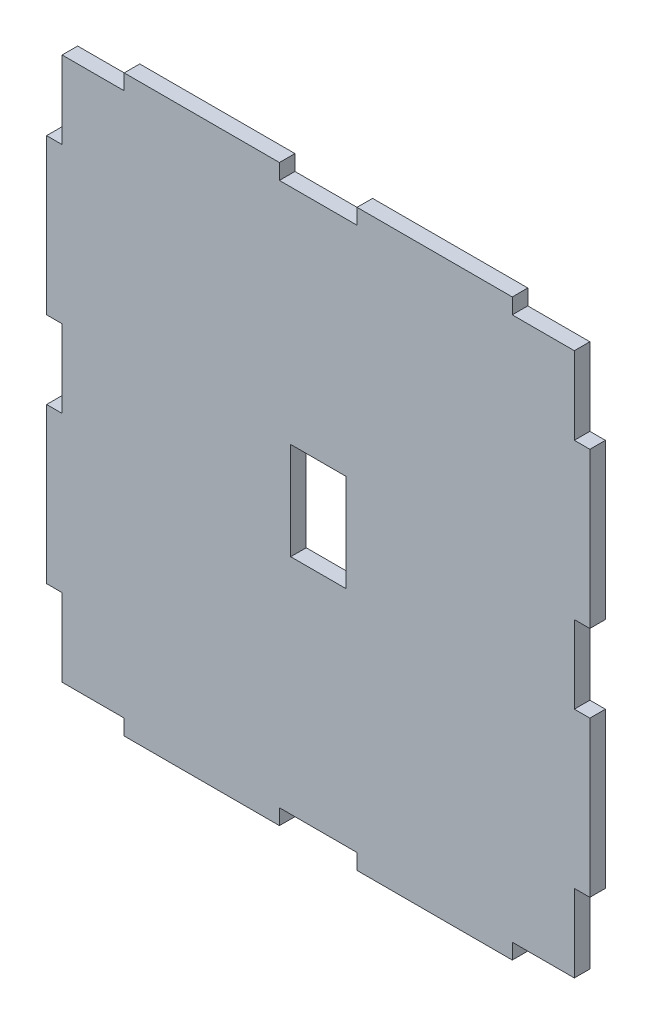
ISO-10303-21;
HEADER;
FILE_DESCRIPTION(('STEP AP214'),'2;1');
FILE_NAME('part.step','',(''),(''),'','','');
FILE_SCHEMA(('AUTOMOTIVE_DESIGN { 1 0 10303 214 1 1 1 1 }'));
ENDSEC;
DATA;
#1=APPLICATION_CONTEXT('core data for automotive mechanical design processes');
#2=APPLICATION_PROTOCOL_DEFINITION('international standard','automotive_design',2000,#1);
#3=PRODUCT_CONTEXT('',#1,'mechanical');
#4=PRODUCT('Part','Part','',(#3));
#5=PRODUCT_RELATED_PRODUCT_CATEGORY('part','',(#4));
#6=PRODUCT_DEFINITION_FORMATION('','',#4);
#7=PRODUCT_DEFINITION_CONTEXT('part definition',#1,'design');
#8=PRODUCT_DEFINITION('design','',#6,#7);
#9=PRODUCT_DEFINITION_SHAPE('','',#8);
#10=(LENGTH_UNIT() NAMED_UNIT(*) SI_UNIT(.MILLI.,.METRE.));
#11=(NAMED_UNIT(*) PLANE_ANGLE_UNIT() SI_UNIT($,.RADIAN.));
#12=(NAMED_UNIT(*) SI_UNIT($,.STERADIAN.) SOLID_ANGLE_UNIT());
#13=UNCERTAINTY_MEASURE_WITH_UNIT(LENGTH_MEASURE(1.E-05),#10,'distance_accuracy_value','');
#14=(GEOMETRIC_REPRESENTATION_CONTEXT(3) GLOBAL_UNCERTAINTY_ASSIGNED_CONTEXT((#13)) GLOBAL_UNIT_ASSIGNED_CONTEXT((#10,
#11,#12)) REPRESENTATION_CONTEXT('',''));
#15=CARTESIAN_POINT('',(0.,0.,0.));
#16=DIRECTION('',(0.,0.,1.));
#17=DIRECTION('',(1.,0.,0.));
#18=AXIS2_PLACEMENT_3D('',#15,#16,#17);
#19=CARTESIAN_POINT('',(-33.,-35.,2.));
#20=DIRECTION('',(0.,1.,0.));
#21=DIRECTION('',(0.,0.,1.));
#22=AXIS2_PLACEMENT_3D('',#19,#20,#21);
#23=PLANE('',#22);
#24=DIRECTION('',(0.,0.,-1.));
#25=VECTOR('',#24,1.);
#26=CARTESIAN_POINT('',(-25.,-35.,2.));
#27=LINE('',#26,#25);
#28=CARTESIAN_POINT('',(-25.,-35.,2.));
#29=VERTEX_POINT('',#28);
#30=CARTESIAN_POINT('',(-25.,-35.,0.));
#31=VERTEX_POINT('',#30);
#32=EDGE_CURVE('E339',#29,#31,#27,.T.);
#33=ORIENTED_EDGE('',*,*,#32,.F.);
#34=DIRECTION('',(1.,0.,0.));
#35=VECTOR('',#34,1.);
#36=CARTESIAN_POINT('',(-33.,-35.,2.));
#37=LINE('',#36,#35);
#38=CARTESIAN_POINT('',(-33.,-35.,2.));
#39=VERTEX_POINT('',#38);
#40=EDGE_CURVE('E558',#39,#29,#37,.T.);
#41=ORIENTED_EDGE('',*,*,#40,.F.);
#42=DIRECTION('',(0.,0.,-1.));
#43=VECTOR('',#42,1.);
#44=CARTESIAN_POINT('',(-33.,-35.,2.));
#45=LINE('',#44,#43);
#46=CARTESIAN_POINT('',(-33.,-35.,0.));
#47=VERTEX_POINT('',#46);
#48=EDGE_CURVE('E582',#39,#47,#45,.T.);
#49=ORIENTED_EDGE('',*,*,#48,.T.);
#50=DIRECTION('',(1.,0.,0.));
#51=VECTOR('',#50,1.);
#52=CARTESIAN_POINT('',(-33.,-35.,0.));
#53=LINE('',#52,#51);
#54=EDGE_CURVE('E577',#47,#31,#53,.T.);
#55=ORIENTED_EDGE('',*,*,#54,.T.);
#56=EDGE_LOOP('',(#33,#41,#49,#55));
#57=FACE_BOUND('',#56,.T.);
#58=ADVANCED_FACE('F35',(#57),#23,.F.);
#59=DIRECTION('',(0.,0.,-1.));
#60=VECTOR('',#59,1.);
#61=CARTESIAN_POINT('',(-5.,-35.,2.));
#62=LINE('',#61,#60);
#63=CARTESIAN_POINT('',(-5.,-35.,2.));
#64=VERTEX_POINT('',#63);
#65=CARTESIAN_POINT('',(-5.,-35.,0.));
#66=VERTEX_POINT('',#65);
#67=EDGE_CURVE('E352',#64,#66,#62,.T.);
#68=ORIENTED_EDGE('',*,*,#67,.T.);
#69=CARTESIAN_POINT('',(5.,-35.,0.));
#70=VERTEX_POINT('',#69);
#71=EDGE_CURVE('E579',#66,#70,#53,.T.);
#72=ORIENTED_EDGE('',*,*,#71,.T.);
#73=DIRECTION('',(0.,0.,-1.));
#74=VECTOR('',#73,1.);
#75=CARTESIAN_POINT('',(5.,-35.,2.));
#76=LINE('',#75,#74);
#77=CARTESIAN_POINT('',(5.,-35.,2.));
#78=VERTEX_POINT('',#77);
#79=EDGE_CURVE('E374',#78,#70,#76,.T.);
#80=ORIENTED_EDGE('',*,*,#79,.F.);
#81=EDGE_CURVE('E562',#64,#78,#37,.T.);
#82=ORIENTED_EDGE('',*,*,#81,.F.);
#83=EDGE_LOOP('',(#68,#72,#80,#82));
#84=FACE_BOUND('',#83,.T.);
#85=ADVANCED_FACE('F683',(#84),#23,.F.);
#86=CARTESIAN_POINT('',(-33.,35.,2.));
#87=DIRECTION('',(0.,-1.,0.));
#88=DIRECTION('',(0.,0.,-1.));
#89=AXIS2_PLACEMENT_3D('',#86,#87,#88);
#90=PLANE('',#89);
#91=DIRECTION('',(0.,0.,-1.));
#92=VECTOR('',#91,1.);
#93=CARTESIAN_POINT('',(-5.,35.,2.));
#94=LINE('',#93,#92);
#95=CARTESIAN_POINT('',(-5.,35.,2.));
#96=VERTEX_POINT('',#95);
#97=CARTESIAN_POINT('',(-5.,35.,0.));
#98=VERTEX_POINT('',#97);
#99=EDGE_CURVE('E399',#96,#98,#94,.T.);
#100=ORIENTED_EDGE('',*,*,#99,.F.);
#101=DIRECTION('',(-1.,0.,0.));
#102=VECTOR('',#101,1.);
#103=CARTESIAN_POINT('',(-33.,35.,2.));
#104=LINE('',#103,#102);
#105=CARTESIAN_POINT('',(5.,35.,2.));
#106=VERTEX_POINT('',#105);
#107=EDGE_CURVE('E552',#106,#96,#104,.T.);
#108=ORIENTED_EDGE('',*,*,#107,.F.);
#109=DIRECTION('',(0.,0.,-1.));
#110=VECTOR('',#109,1.);
#111=CARTESIAN_POINT('',(5.,35.,2.));
#112=LINE('',#111,#110);
#113=CARTESIAN_POINT('',(5.,35.,0.));
#114=VERTEX_POINT('',#113);
#115=EDGE_CURVE('E428',#106,#114,#112,.T.);
#116=ORIENTED_EDGE('',*,*,#115,.T.);
#117=DIRECTION('',(-1.,0.,0.));
#118=VECTOR('',#117,1.);
#119=CARTESIAN_POINT('',(-33.,35.,0.));
#120=LINE('',#119,#118);
#121=EDGE_CURVE('E572',#114,#98,#120,.T.);
#122=ORIENTED_EDGE('',*,*,#121,.T.);
#123=EDGE_LOOP('',(#100,#108,#116,#122));
#124=FACE_BOUND('',#123,.T.);
#125=ADVANCED_FACE('F622',(#124),#90,.F.);
#126=DIRECTION('',(0.,0.,-1.));
#127=VECTOR('',#126,1.);
#128=CARTESIAN_POINT('',(25.,35.,2.));
#129=LINE('',#128,#127);
#130=CARTESIAN_POINT('',(25.,35.,2.));
#131=VERTEX_POINT('',#130);
#132=CARTESIAN_POINT('',(25.,35.,0.));
#133=VERTEX_POINT('',#132);
#134=EDGE_CURVE('E431',#131,#133,#129,.T.);
#135=ORIENTED_EDGE('',*,*,#134,.F.);
#136=CARTESIAN_POINT('',(33.,35.,2.));
#137=VERTEX_POINT('',#136);
#138=EDGE_CURVE('E548',#137,#131,#104,.T.);
#139=ORIENTED_EDGE('',*,*,#138,.F.);
#140=DIRECTION('',(0.,0.,-1.));
#141=VECTOR('',#140,1.);
#142=CARTESIAN_POINT('',(33.,35.,2.));
#143=LINE('',#142,#141);
#144=CARTESIAN_POINT('',(33.,35.,0.));
#145=VERTEX_POINT('',#144);
#146=EDGE_CURVE('E11',#137,#145,#143,.T.);
#147=ORIENTED_EDGE('',*,*,#146,.T.);
#148=EDGE_CURVE('E568',#145,#133,#120,.T.);
#149=ORIENTED_EDGE('',*,*,#148,.T.);
#150=EDGE_LOOP('',(#135,#139,#147,#149));
#151=FACE_BOUND('',#150,.T.);
#152=ADVANCED_FACE('F637',(#151),#90,.F.);
#153=CARTESIAN_POINT('',(33.,-35.,2.));
#154=DIRECTION('',(-1.,0.,0.));
#155=DIRECTION('',(0.,0.,1.));
#156=AXIS2_PLACEMENT_3D('',#153,#154,#155);
#157=PLANE('',#156);
#158=DIRECTION('',(0.,0.,-1.));
#159=VECTOR('',#158,1.);
#160=CARTESIAN_POINT('',(33.,5.,2.));
#161=LINE('',#160,#159);
#162=CARTESIAN_POINT('',(33.,5.,2.));
#163=VERTEX_POINT('',#162);
#164=CARTESIAN_POINT('',(33.,5.,0.));
#165=VERTEX_POINT('',#164);
#166=EDGE_CURVE('E456',#163,#165,#161,.T.);
#167=ORIENTED_EDGE('',*,*,#166,.F.);
#168=DIRECTION('',(0.,1.,0.));
#169=VECTOR('',#168,1.);
#170=CARTESIAN_POINT('',(33.,-35.,2.));
#171=LINE('',#170,#169);
#172=CARTESIAN_POINT('',(33.,-5.,2.));
#173=VERTEX_POINT('',#172);
#174=EDGE_CURVE('E546',#173,#163,#171,.T.);
#175=ORIENTED_EDGE('',*,*,#174,.F.);
#176=DIRECTION('',(0.,0.,-1.));
#177=VECTOR('',#176,1.);
#178=CARTESIAN_POINT('',(33.,-5.,2.));
#179=LINE('',#178,#177);
#180=CARTESIAN_POINT('',(33.,-5.,0.));
#181=VERTEX_POINT('',#180);
#182=EDGE_CURVE('E478',#173,#181,#179,.T.);
#183=ORIENTED_EDGE('',*,*,#182,.T.);
#184=DIRECTION('',(0.,1.,0.));
#185=VECTOR('',#184,1.);
#186=CARTESIAN_POINT('',(33.,-35.,0.));
#187=LINE('',#186,#185);
#188=EDGE_CURVE('E567',#181,#165,#187,.T.);
#189=ORIENTED_EDGE('',*,*,#188,.T.);
#190=EDGE_LOOP('',(#167,#175,#183,#189));
#191=FACE_BOUND('',#190,.T.);
#192=ADVANCED_FACE('F645',(#191),#157,.F.);
#193=DIRECTION('',(0.,0.,-1.));
#194=VECTOR('',#193,1.);
#195=CARTESIAN_POINT('',(33.,-25.,2.));
#196=LINE('',#195,#194);
#197=CARTESIAN_POINT('',(33.,-25.,2.));
#198=VERTEX_POINT('',#197);
#199=CARTESIAN_POINT('',(33.,-25.,0.));
#200=VERTEX_POINT('',#199);
#201=EDGE_CURVE('E482',#198,#200,#196,.T.);
#202=ORIENTED_EDGE('',*,*,#201,.F.);
#203=CARTESIAN_POINT('',(33.,-35.,2.));
#204=VERTEX_POINT('',#203);
#205=EDGE_CURVE('E542',#204,#198,#171,.T.);
#206=ORIENTED_EDGE('',*,*,#205,.F.);
#207=DIRECTION('',(0.,0.,-1.));
#208=VECTOR('',#207,1.);
#209=CARTESIAN_POINT('',(33.,-35.,2.));
#210=LINE('',#209,#208);
#211=CARTESIAN_POINT('',(33.,-35.,0.));
#212=VERTEX_POINT('',#211);
#213=EDGE_CURVE('E561',#204,#212,#210,.T.);
#214=ORIENTED_EDGE('',*,*,#213,.T.);
#215=EDGE_CURVE('E563',#212,#200,#187,.T.);
#216=ORIENTED_EDGE('',*,*,#215,.T.);
#217=EDGE_LOOP('',(#202,#206,#214,#216));
#218=FACE_BOUND('',#217,.T.);
#219=ADVANCED_FACE('F673',(#218),#157,.F.);
#220=CARTESIAN_POINT('',(-33.,-35.,2.));
#221=DIRECTION('',(1.,0.,0.));
#222=DIRECTION('',(0.,0.,-1.));
#223=AXIS2_PLACEMENT_3D('',#220,#221,#222);
#224=PLANE('',#223);
#225=DIRECTION('',(0.,0.,-1.));
#226=VECTOR('',#225,1.);
#227=CARTESIAN_POINT('',(-33.,5.,2.));
#228=LINE('',#227,#226);
#229=CARTESIAN_POINT('',(-33.,5.,2.));
#230=VERTEX_POINT('',#229);
#231=CARTESIAN_POINT('',(-33.,5.,0.));
#232=VERTEX_POINT('',#231);
#233=EDGE_CURVE('E508',#230,#232,#228,.T.);
#234=ORIENTED_EDGE('',*,*,#233,.T.);
#235=DIRECTION('',(0.,-1.,0.));
#236=VECTOR('',#235,1.);
#237=CARTESIAN_POINT('',(-33.,-35.,0.));
#238=LINE('',#237,#236);
#239=CARTESIAN_POINT('',(-33.,-5.,0.));
#240=VERTEX_POINT('',#239);
#241=EDGE_CURVE('E576',#232,#240,#238,.T.);
#242=ORIENTED_EDGE('',*,*,#241,.T.);
#243=DIRECTION('',(0.,0.,-1.));
#244=VECTOR('',#243,1.);
#245=CARTESIAN_POINT('',(-33.,-5.,2.));
#246=LINE('',#245,#244);
#247=CARTESIAN_POINT('',(-33.,-5.,2.));
#248=VERTEX_POINT('',#247);
#249=EDGE_CURVE('E538',#248,#240,#246,.T.);
#250=ORIENTED_EDGE('',*,*,#249,.F.);
#251=DIRECTION('',(0.,-1.,0.));
#252=VECTOR('',#251,1.);
#253=CARTESIAN_POINT('',(-33.,-35.,2.));
#254=LINE('',#253,#252);
#255=EDGE_CURVE('E557',#230,#248,#254,.T.);
#256=ORIENTED_EDGE('',*,*,#255,.F.);
#257=EDGE_LOOP('',(#234,#242,#250,#256));
#258=FACE_BOUND('',#257,.T.);
#259=ADVANCED_FACE('F716',(#258),#224,.F.);
#260=CARTESIAN_POINT('',(-33.,35.,0.));
#261=VERTEX_POINT('',#260);
#262=CARTESIAN_POINT('',(-33.,25.,0.));
#263=VERTEX_POINT('',#262);
#264=EDGE_CURVE('E573',#261,#263,#238,.T.);
#265=ORIENTED_EDGE('',*,*,#264,.T.);
#266=DIRECTION('',(0.,0.,-1.));
#267=VECTOR('',#266,1.);
#268=CARTESIAN_POINT('',(-33.,25.,2.));
#269=LINE('',#268,#267);
#270=CARTESIAN_POINT('',(-33.,25.,2.));
#271=VERTEX_POINT('',#270);
#272=EDGE_CURVE('E511',#271,#263,#269,.T.);
#273=ORIENTED_EDGE('',*,*,#272,.F.);
#274=CARTESIAN_POINT('',(-33.,35.,2.));
#275=VERTEX_POINT('',#274);
#276=EDGE_CURVE('E553',#275,#271,#254,.T.);
#277=ORIENTED_EDGE('',*,*,#276,.F.);
#278=DIRECTION('',(0.,0.,-1.));
#279=VECTOR('',#278,1.);
#280=CARTESIAN_POINT('',(-33.,35.,2.));
#281=LINE('',#280,#279);
#282=EDGE_CURVE('E43',#275,#261,#281,.T.);
#283=ORIENTED_EDGE('',*,*,#282,.T.);
#284=EDGE_LOOP('',(#265,#273,#277,#283));
#285=FACE_BOUND('',#284,.T.);
#286=ADVANCED_FACE('F589',(#285),#224,.F.);
#287=CARTESIAN_POINT('',(33.,25.,2.));
#288=VERTEX_POINT('',#287);
#289=EDGE_CURVE('E547',#288,#137,#171,.T.);
#290=ORIENTED_EDGE('',*,*,#289,.F.);
#291=DIRECTION('',(0.,0.,-1.));
#292=VECTOR('',#291,1.);
#293=CARTESIAN_POINT('',(33.,25.,2.));
#294=LINE('',#293,#292);
#295=CARTESIAN_POINT('',(33.,25.,0.));
#296=VERTEX_POINT('',#295);
#297=EDGE_CURVE('E453',#288,#296,#294,.T.);
#298=ORIENTED_EDGE('',*,*,#297,.T.);
#299=EDGE_CURVE('E534',#296,#145,#187,.T.);
#300=ORIENTED_EDGE('',*,*,#299,.T.);
#301=ORIENTED_EDGE('',*,*,#146,.F.);
#302=EDGE_LOOP('',(#290,#298,#300,#301));
#303=FACE_BOUND('',#302,.T.);
#304=ADVANCED_FACE('F37',(#303),#157,.F.);
#305=CARTESIAN_POINT('',(-25.,35.,2.));
#306=VERTEX_POINT('',#305);
#307=EDGE_CURVE('E545',#306,#275,#104,.T.);
#308=ORIENTED_EDGE('',*,*,#307,.F.);
#309=DIRECTION('',(0.,0.,-1.));
#310=VECTOR('',#309,1.);
#311=CARTESIAN_POINT('',(-25.,35.,2.));
#312=LINE('',#311,#310);
#313=CARTESIAN_POINT('',(-25.,35.,0.));
#314=VERTEX_POINT('',#313);
#315=EDGE_CURVE('E392',#306,#314,#312,.T.);
#316=ORIENTED_EDGE('',*,*,#315,.T.);
#317=EDGE_CURVE('E566',#314,#261,#120,.T.);
#318=ORIENTED_EDGE('',*,*,#317,.T.);
#319=ORIENTED_EDGE('',*,*,#282,.F.);
#320=EDGE_LOOP('',(#308,#316,#318,#319));
#321=FACE_BOUND('',#320,.T.);
#322=ADVANCED_FACE('F620',(#321),#90,.F.);
#323=CARTESIAN_POINT('',(-33.,-25.,2.));
#324=VERTEX_POINT('',#323);
#325=EDGE_CURVE('E551',#324,#39,#254,.T.);
#326=ORIENTED_EDGE('',*,*,#325,.F.);
#327=DIRECTION('',(0.,0.,-1.));
#328=VECTOR('',#327,1.);
#329=CARTESIAN_POINT('',(-33.,-25.,2.));
#330=LINE('',#329,#328);
#331=CARTESIAN_POINT('',(-33.,-25.,0.));
#332=VERTEX_POINT('',#331);
#333=EDGE_CURVE('E535',#324,#332,#330,.T.);
#334=ORIENTED_EDGE('',*,*,#333,.T.);
#335=EDGE_CURVE('E571',#332,#47,#238,.T.);
#336=ORIENTED_EDGE('',*,*,#335,.T.);
#337=ORIENTED_EDGE('',*,*,#48,.F.);
#338=EDGE_LOOP('',(#326,#334,#336,#337));
#339=FACE_BOUND('',#338,.T.);
#340=ADVANCED_FACE('F713',(#339),#224,.F.);
#341=CARTESIAN_POINT('',(25.,-35.,2.));
#342=VERTEX_POINT('',#341);
#343=EDGE_CURVE('E556',#342,#204,#37,.T.);
#344=ORIENTED_EDGE('',*,*,#343,.F.);
#345=DIRECTION('',(0.,0.,-1.));
#346=VECTOR('',#345,1.);
#347=CARTESIAN_POINT('',(25.,-35.,2.));
#348=LINE('',#347,#346);
#349=CARTESIAN_POINT('',(25.,-35.,0.));
#350=VERTEX_POINT('',#349);
#351=EDGE_CURVE('E366',#342,#350,#348,.T.);
#352=ORIENTED_EDGE('',*,*,#351,.T.);
#353=EDGE_CURVE('E575',#350,#212,#53,.T.);
#354=ORIENTED_EDGE('',*,*,#353,.T.);
#355=ORIENTED_EDGE('',*,*,#213,.F.);
#356=EDGE_LOOP('',(#344,#352,#354,#355));
#357=FACE_BOUND('',#356,.T.);
#358=ADVANCED_FACE('F678',(#357),#23,.F.);
#359=CARTESIAN_POINT('',(0.,0.,2.));
#360=DIRECTION('',(0.,0.,-1.));
#361=DIRECTION('',(-1.,0.,0.));
#362=AXIS2_PLACEMENT_3D('',#359,#360,#361);
#363=PLANE('',#362);
#364=DIRECTION('',(-1.,0.,0.));
#365=VECTOR('',#364,1.);
#366=CARTESIAN_POINT('',(0.,-6.265,2.));
#367=LINE('',#366,#365);
#368=CARTESIAN_POINT('',(3.55,-6.265,2.));
#369=VERTEX_POINT('',#368);
#370=CARTESIAN_POINT('',(-3.55,-6.265,2.));
#371=VERTEX_POINT('',#370);
#372=EDGE_CURVE('E323',#369,#371,#367,.T.);
#373=ORIENTED_EDGE('',*,*,#372,.T.);
#374=DIRECTION('',(0.,1.,0.));
#375=VECTOR('',#374,1.);
#376=CARTESIAN_POINT('',(-3.55,0.,2.));
#377=LINE('',#376,#375);
#378=CARTESIAN_POINT('',(-3.55,6.265,2.));
#379=VERTEX_POINT('',#378);
#380=EDGE_CURVE('E326',#371,#379,#377,.T.);
#381=ORIENTED_EDGE('',*,*,#380,.T.);
#382=DIRECTION('',(1.,0.,0.));
#383=VECTOR('',#382,1.);
#384=CARTESIAN_POINT('',(0.,6.265,2.));
#385=LINE('',#384,#383);
#386=CARTESIAN_POINT('',(3.55,6.265,2.));
#387=VERTEX_POINT('',#386);
#388=EDGE_CURVE('E318',#379,#387,#385,.T.);
#389=ORIENTED_EDGE('',*,*,#388,.T.);
#390=DIRECTION('',(0.,-1.,0.));
#391=VECTOR('',#390,1.);
#392=CARTESIAN_POINT('',(3.55,0.,2.));
#393=LINE('',#392,#391);
#394=EDGE_CURVE('E298',#387,#369,#393,.T.);
#395=ORIENTED_EDGE('',*,*,#394,.T.);
#396=EDGE_LOOP('',(#373,#381,#389,#395));
#397=FACE_BOUND('',#396,.T.);
#398=ORIENTED_EDGE('',*,*,#205,.T.);
#399=DIRECTION('',(1.,0.,0.));
#400=VECTOR('',#399,1.);
#401=CARTESIAN_POINT('',(0.,-25.,2.));
#402=LINE('',#401,#400);
#403=CARTESIAN_POINT('',(35.,-25.,2.));
#404=VERTEX_POINT('',#403);
#405=EDGE_CURVE('E468',#198,#404,#402,.T.);
#406=ORIENTED_EDGE('',*,*,#405,.T.);
#407=DIRECTION('',(0.,-1.,0.));
#408=VECTOR('',#407,1.);
#409=CARTESIAN_POINT('',(35.,0.,2.));
#410=LINE('',#409,#408);
#411=CARTESIAN_POINT('',(35.,-5.,2.));
#412=VERTEX_POINT('',#411);
#413=EDGE_CURVE('E464',#412,#404,#410,.T.);
#414=ORIENTED_EDGE('',*,*,#413,.F.);
#415=DIRECTION('',(1.,0.,0.));
#416=VECTOR('',#415,1.);
#417=CARTESIAN_POINT('',(0.,-5.00000000000001,2.));
#418=LINE('',#417,#416);
#419=EDGE_CURVE('E461',#173,#412,#418,.T.);
#420=ORIENTED_EDGE('',*,*,#419,.F.);
#421=ORIENTED_EDGE('',*,*,#174,.T.);
#422=DIRECTION('',(1.,0.,0.));
#423=VECTOR('',#422,1.);
#424=CARTESIAN_POINT('',(0.,5.,2.));
#425=LINE('',#424,#423);
#426=CARTESIAN_POINT('',(35.,5.,2.));
#427=VERTEX_POINT('',#426);
#428=EDGE_CURVE('E437',#163,#427,#425,.T.);
#429=ORIENTED_EDGE('',*,*,#428,.T.);
#430=DIRECTION('',(0.,1.,0.));
#431=VECTOR('',#430,1.);
#432=CARTESIAN_POINT('',(35.,0.,2.));
#433=LINE('',#432,#431);
#434=CARTESIAN_POINT('',(35.,25.,2.));
#435=VERTEX_POINT('',#434);
#436=EDGE_CURVE('E435',#427,#435,#433,.T.);
#437=ORIENTED_EDGE('',*,*,#436,.T.);
#438=DIRECTION('',(1.,0.,0.));
#439=VECTOR('',#438,1.);
#440=CARTESIAN_POINT('',(0.,25.,2.));
#441=LINE('',#440,#439);
#442=EDGE_CURVE('E440',#288,#435,#441,.T.);
#443=ORIENTED_EDGE('',*,*,#442,.F.);
#444=ORIENTED_EDGE('',*,*,#289,.T.);
#445=ORIENTED_EDGE('',*,*,#138,.T.);
#446=DIRECTION('',(0.,1.,0.));
#447=VECTOR('',#446,1.);
#448=CARTESIAN_POINT('',(25.,0.,2.));
#449=LINE('',#448,#447);
#450=CARTESIAN_POINT('',(25.,37.,2.));
#451=VERTEX_POINT('',#450);
#452=EDGE_CURVE('E412',#131,#451,#449,.T.);
#453=ORIENTED_EDGE('',*,*,#452,.T.);
#454=DIRECTION('',(-1.,0.,0.));
#455=VECTOR('',#454,1.);
#456=CARTESIAN_POINT('',(0.,37.,2.));
#457=LINE('',#456,#455);
#458=CARTESIAN_POINT('',(5.,37.,2.));
#459=VERTEX_POINT('',#458);
#460=EDGE_CURVE('E410',#451,#459,#457,.T.);
#461=ORIENTED_EDGE('',*,*,#460,.T.);
#462=DIRECTION('',(0.,1.,0.));
#463=VECTOR('',#462,1.);
#464=CARTESIAN_POINT('',(5.,0.,2.));
#465=LINE('',#464,#463);
#466=EDGE_CURVE('E415',#106,#459,#465,.T.);
#467=ORIENTED_EDGE('',*,*,#466,.F.);
#468=ORIENTED_EDGE('',*,*,#107,.T.);
#469=DIRECTION('',(0.,1.,0.));
#470=VECTOR('',#469,1.);
#471=CARTESIAN_POINT('',(-5.,0.,2.));
#472=LINE('',#471,#470);
#473=CARTESIAN_POINT('',(-5.,37.,2.));
#474=VERTEX_POINT('',#473);
#475=EDGE_CURVE('E390',#96,#474,#472,.T.);
#476=ORIENTED_EDGE('',*,*,#475,.T.);
#477=DIRECTION('',(-1.,0.,0.));
#478=VECTOR('',#477,1.);
#479=CARTESIAN_POINT('',(0.,37.,2.));
#480=LINE('',#479,#478);
#481=CARTESIAN_POINT('',(-25.,37.,2.));
#482=VERTEX_POINT('',#481);
#483=EDGE_CURVE('E387',#474,#482,#480,.T.);
#484=ORIENTED_EDGE('',*,*,#483,.T.);
#485=DIRECTION('',(0.,1.,0.));
#486=VECTOR('',#485,1.);
#487=CARTESIAN_POINT('',(-25.,0.,2.));
#488=LINE('',#487,#486);
#489=EDGE_CURVE('E384',#306,#482,#488,.T.);
#490=ORIENTED_EDGE('',*,*,#489,.F.);
#491=ORIENTED_EDGE('',*,*,#307,.T.);
#492=ORIENTED_EDGE('',*,*,#276,.T.);
#493=DIRECTION('',(1.,0.,0.));
#494=VECTOR('',#493,1.);
#495=CARTESIAN_POINT('',(0.,25.,2.));
#496=LINE('',#495,#494);
#497=CARTESIAN_POINT('',(-35.,25.,2.));
#498=VERTEX_POINT('',#497);
#499=EDGE_CURVE('E490',#498,#271,#496,.T.);
#500=ORIENTED_EDGE('',*,*,#499,.F.);
#501=DIRECTION('',(0.,1.,0.));
#502=VECTOR('',#501,1.);
#503=CARTESIAN_POINT('',(-35.,0.,2.));
#504=LINE('',#503,#502);
#505=CARTESIAN_POINT('',(-35.,5.,2.));
#506=VERTEX_POINT('',#505);
#507=EDGE_CURVE('E487',#506,#498,#504,.T.);
#508=ORIENTED_EDGE('',*,*,#507,.F.);
#509=DIRECTION('',(1.,0.,0.));
#510=VECTOR('',#509,1.);
#511=CARTESIAN_POINT('',(0.,5.,2.));
#512=LINE('',#511,#510);
#513=EDGE_CURVE('E494',#506,#230,#512,.T.);
#514=ORIENTED_EDGE('',*,*,#513,.T.);
#515=ORIENTED_EDGE('',*,*,#255,.T.);
#516=DIRECTION('',(1.,0.,0.));
#517=VECTOR('',#516,1.);
#518=CARTESIAN_POINT('',(0.,-4.99999999999999,2.));
#519=LINE('',#518,#517);
#520=CARTESIAN_POINT('',(-35.,-5.,2.));
#521=VERTEX_POINT('',#520);
#522=EDGE_CURVE('E517',#521,#248,#519,.T.);
#523=ORIENTED_EDGE('',*,*,#522,.F.);
#524=DIRECTION('',(0.,-1.,0.));
#525=VECTOR('',#524,1.);
#526=CARTESIAN_POINT('',(-35.,0.,2.));
#527=LINE('',#526,#525);
#528=CARTESIAN_POINT('',(-35.,-25.,2.));
#529=VERTEX_POINT('',#528);
#530=EDGE_CURVE('E515',#521,#529,#527,.T.);
#531=ORIENTED_EDGE('',*,*,#530,.T.);
#532=DIRECTION('',(-1.,0.,0.));
#533=VECTOR('',#532,1.);
#534=CARTESIAN_POINT('',(0.,-25.,2.));
#535=LINE('',#534,#533);
#536=EDGE_CURVE('E521',#324,#529,#535,.T.);
#537=ORIENTED_EDGE('',*,*,#536,.F.);
#538=ORIENTED_EDGE('',*,*,#325,.T.);
#539=ORIENTED_EDGE('',*,*,#40,.T.);
#540=DIRECTION('',(0.,-1.,0.));
#541=VECTOR('',#540,1.);
#542=CARTESIAN_POINT('',(-25.,0.,2.));
#543=LINE('',#542,#541);
#544=CARTESIAN_POINT('',(-25.,-37.,2.));
#545=VERTEX_POINT('',#544);
#546=EDGE_CURVE('E330',#29,#545,#543,.T.);
#547=ORIENTED_EDGE('',*,*,#546,.T.);
#548=DIRECTION('',(-1.,0.,0.));
#549=VECTOR('',#548,1.);
#550=CARTESIAN_POINT('',(0.,-37.,2.));
#551=LINE('',#550,#549);
#552=CARTESIAN_POINT('',(-5.,-37.,2.));
#553=VERTEX_POINT('',#552);
#554=EDGE_CURVE('E336',#553,#545,#551,.T.);
#555=ORIENTED_EDGE('',*,*,#554,.F.);
#556=DIRECTION('',(0.,1.,0.));
#557=VECTOR('',#556,1.);
#558=CARTESIAN_POINT('',(-5.,0.,2.));
#559=LINE('',#558,#557);
#560=EDGE_CURVE('E332',#553,#64,#559,.T.);
#561=ORIENTED_EDGE('',*,*,#560,.T.);
#562=ORIENTED_EDGE('',*,*,#81,.T.);
#563=DIRECTION('',(0.,1.,0.));
#564=VECTOR('',#563,1.);
#565=CARTESIAN_POINT('',(4.99999999999999,0.,2.));
#566=LINE('',#565,#564);
#567=CARTESIAN_POINT('',(5.,-37.,2.));
#568=VERTEX_POINT('',#567);
#569=EDGE_CURVE('E363',#568,#78,#566,.T.);
#570=ORIENTED_EDGE('',*,*,#569,.F.);
#571=DIRECTION('',(1.,0.,0.));
#572=VECTOR('',#571,1.);
#573=CARTESIAN_POINT('',(0.,-37.,2.));
#574=LINE('',#573,#572);
#575=CARTESIAN_POINT('',(25.,-37.,2.));
#576=VERTEX_POINT('',#575);
#577=EDGE_CURVE('E360',#568,#576,#574,.T.);
#578=ORIENTED_EDGE('',*,*,#577,.T.);
#579=DIRECTION('',(0.,-1.,0.));
#580=VECTOR('',#579,1.);
#581=CARTESIAN_POINT('',(25.,0.,2.));
#582=LINE('',#581,#580);
#583=EDGE_CURVE('E357',#342,#576,#582,.T.);
#584=ORIENTED_EDGE('',*,*,#583,.F.);
#585=ORIENTED_EDGE('',*,*,#343,.T.);
#586=EDGE_LOOP('',(#398,#406,#414,#420,#421,#429,#437,#443,#444,#445,#453,#461,#467,#468,#476,
#484,#490,#491,#492,#500,#508,#514,#515,#523,#531,#537,#538,#539,#547,#555,#561,#562,#570,#578,
#584,#585));
#587=FACE_BOUND('',#586,.T.);
#588=ADVANCED_FACE('F599',(#397,#587),#363,.F.);
#589=CARTESIAN_POINT('',(0.,0.,0.));
#590=DIRECTION('',(0.,0.,-1.));
#591=DIRECTION('',(-1.,0.,0.));
#592=AXIS2_PLACEMENT_3D('',#589,#590,#591);
#593=PLANE('',#592);
#594=DIRECTION('',(0.,1.,0.));
#595=VECTOR('',#594,1.);
#596=CARTESIAN_POINT('',(-3.55,-6.265,0.));
#597=LINE('',#596,#595);
#598=CARTESIAN_POINT('',(-3.55,-6.265,0.));
#599=VERTEX_POINT('',#598);
#600=CARTESIAN_POINT('',(-3.55,6.265,0.));
#601=VERTEX_POINT('',#600);
#602=EDGE_CURVE('E58',#599,#601,#597,.T.);
#603=ORIENTED_EDGE('',*,*,#602,.F.);
#604=DIRECTION('',(-1.,0.,0.));
#605=VECTOR('',#604,1.);
#606=CARTESIAN_POINT('',(3.55,-6.265,0.));
#607=LINE('',#606,#605);
#608=CARTESIAN_POINT('',(3.55,-6.265,0.));
#609=VERTEX_POINT('',#608);
#610=EDGE_CURVE('E311',#609,#599,#607,.T.);
#611=ORIENTED_EDGE('',*,*,#610,.F.);
#612=DIRECTION('',(0.,-1.,0.));
#613=VECTOR('',#612,1.);
#614=CARTESIAN_POINT('',(3.55,-6.265,0.));
#615=LINE('',#614,#613);
#616=CARTESIAN_POINT('',(3.55,6.265,0.));
#617=VERTEX_POINT('',#616);
#618=EDGE_CURVE('E295',#617,#609,#615,.T.);
#619=ORIENTED_EDGE('',*,*,#618,.F.);
#620=DIRECTION('',(1.,0.,0.));
#621=VECTOR('',#620,1.);
#622=CARTESIAN_POINT('',(3.55,6.265,0.));
#623=LINE('',#622,#621);
#624=EDGE_CURVE('E304',#601,#617,#623,.T.);
#625=ORIENTED_EDGE('',*,*,#624,.F.);
#626=EDGE_LOOP('',(#603,#611,#619,#625));
#627=FACE_BOUND('',#626,.T.);
#628=ORIENTED_EDGE('',*,*,#215,.F.);
#629=ORIENTED_EDGE('',*,*,#353,.F.);
#630=DIRECTION('',(0.,-1.,0.));
#631=VECTOR('',#630,1.);
#632=CARTESIAN_POINT('',(25.,0.,0.));
#633=LINE('',#632,#631);
#634=CARTESIAN_POINT('',(25.,-37.,0.));
#635=VERTEX_POINT('',#634);
#636=EDGE_CURVE('E349',#350,#635,#633,.T.);
#637=ORIENTED_EDGE('',*,*,#636,.T.);
#638=DIRECTION('',(1.,0.,0.));
#639=VECTOR('',#638,1.);
#640=CARTESIAN_POINT('',(0.,-37.,0.));
#641=LINE('',#640,#639);
#642=CARTESIAN_POINT('',(5.,-37.,0.));
#643=VERTEX_POINT('',#642);
#644=EDGE_CURVE('E369',#643,#635,#641,.T.);
#645=ORIENTED_EDGE('',*,*,#644,.F.);
#646=DIRECTION('',(0.,1.,0.));
#647=VECTOR('',#646,1.);
#648=CARTESIAN_POINT('',(4.99999999999999,0.,0.));
#649=LINE('',#648,#647);
#650=EDGE_CURVE('E361',#643,#70,#649,.T.);
#651=ORIENTED_EDGE('',*,*,#650,.T.);
#652=ORIENTED_EDGE('',*,*,#71,.F.);
#653=DIRECTION('',(0.,1.,0.));
#654=VECTOR('',#653,1.);
#655=CARTESIAN_POINT('',(-5.,0.,0.));
#656=LINE('',#655,#654);
#657=CARTESIAN_POINT('',(-5.,-37.,0.));
#658=VERTEX_POINT('',#657);
#659=EDGE_CURVE('E342',#658,#66,#656,.T.);
#660=ORIENTED_EDGE('',*,*,#659,.F.);
#661=DIRECTION('',(-1.,0.,0.));
#662=VECTOR('',#661,1.);
#663=CARTESIAN_POINT('',(0.,-37.,0.));
#664=LINE('',#663,#662);
#665=CARTESIAN_POINT('',(-25.,-37.,0.));
#666=VERTEX_POINT('',#665);
#667=EDGE_CURVE('E333',#658,#666,#664,.T.);
#668=ORIENTED_EDGE('',*,*,#667,.T.);
#669=DIRECTION('',(0.,-1.,0.));
#670=VECTOR('',#669,1.);
#671=CARTESIAN_POINT('',(-25.,0.,0.));
#672=LINE('',#671,#670);
#673=EDGE_CURVE('E329',#31,#666,#672,.T.);
#674=ORIENTED_EDGE('',*,*,#673,.F.);
#675=ORIENTED_EDGE('',*,*,#54,.F.);
#676=ORIENTED_EDGE('',*,*,#335,.F.);
#677=DIRECTION('',(-1.,0.,0.));
#678=VECTOR('',#677,1.);
#679=CARTESIAN_POINT('',(0.,-25.,0.));
#680=LINE('',#679,#678);
#681=CARTESIAN_POINT('',(-35.,-25.,0.));
#682=VERTEX_POINT('',#681);
#683=EDGE_CURVE('E518',#332,#682,#680,.T.);
#684=ORIENTED_EDGE('',*,*,#683,.T.);
#685=DIRECTION('',(0.,-1.,0.));
#686=VECTOR('',#685,1.);
#687=CARTESIAN_POINT('',(-35.,0.,0.));
#688=LINE('',#687,#686);
#689=CARTESIAN_POINT('',(-35.,-5.,0.));
#690=VERTEX_POINT('',#689);
#691=EDGE_CURVE('E507',#690,#682,#688,.T.);
#692=ORIENTED_EDGE('',*,*,#691,.F.);
#693=DIRECTION('',(1.,0.,0.));
#694=VECTOR('',#693,1.);
#695=CARTESIAN_POINT('',(0.,-4.99999999999999,0.));
#696=LINE('',#695,#694);
#697=EDGE_CURVE('E527',#690,#240,#696,.T.);
#698=ORIENTED_EDGE('',*,*,#697,.T.);
#699=ORIENTED_EDGE('',*,*,#241,.F.);
#700=DIRECTION('',(1.,0.,0.));
#701=VECTOR('',#700,1.);
#702=CARTESIAN_POINT('',(0.,5.,0.));
#703=LINE('',#702,#701);
#704=CARTESIAN_POINT('',(-35.,5.,0.));
#705=VERTEX_POINT('',#704);
#706=EDGE_CURVE('E491',#705,#232,#703,.T.);
#707=ORIENTED_EDGE('',*,*,#706,.F.);
#708=DIRECTION('',(0.,1.,0.));
#709=VECTOR('',#708,1.);
#710=CARTESIAN_POINT('',(-35.,0.,0.));
#711=LINE('',#710,#709);
#712=CARTESIAN_POINT('',(-35.,25.,0.));
#713=VERTEX_POINT('',#712);
#714=EDGE_CURVE('E481',#705,#713,#711,.T.);
#715=ORIENTED_EDGE('',*,*,#714,.T.);
#716=DIRECTION('',(1.,0.,0.));
#717=VECTOR('',#716,1.);
#718=CARTESIAN_POINT('',(0.,25.,0.));
#719=LINE('',#718,#717);
#720=EDGE_CURVE('E500',#713,#263,#719,.T.);
#721=ORIENTED_EDGE('',*,*,#720,.T.);
#722=ORIENTED_EDGE('',*,*,#264,.F.);
#723=ORIENTED_EDGE('',*,*,#317,.F.);
#724=DIRECTION('',(0.,1.,0.));
#725=VECTOR('',#724,1.);
#726=CARTESIAN_POINT('',(-25.,0.,0.));
#727=LINE('',#726,#725);
#728=CARTESIAN_POINT('',(-25.,37.,0.));
#729=VERTEX_POINT('',#728);
#730=EDGE_CURVE('E377',#314,#729,#727,.T.);
#731=ORIENTED_EDGE('',*,*,#730,.T.);
#732=DIRECTION('',(-1.,0.,0.));
#733=VECTOR('',#732,1.);
#734=CARTESIAN_POINT('',(0.,37.,0.));
#735=LINE('',#734,#733);
#736=CARTESIAN_POINT('',(-5.,37.,0.));
#737=VERTEX_POINT('',#736);
#738=EDGE_CURVE('E395',#737,#729,#735,.T.);
#739=ORIENTED_EDGE('',*,*,#738,.F.);
#740=DIRECTION('',(0.,1.,0.));
#741=VECTOR('',#740,1.);
#742=CARTESIAN_POINT('',(-5.,0.,0.));
#743=LINE('',#742,#741);
#744=EDGE_CURVE('E388',#98,#737,#743,.T.);
#745=ORIENTED_EDGE('',*,*,#744,.F.);
#746=ORIENTED_EDGE('',*,*,#121,.F.);
#747=DIRECTION('',(0.,1.,0.));
#748=VECTOR('',#747,1.);
#749=CARTESIAN_POINT('',(5.,0.,0.));
#750=LINE('',#749,#748);
#751=CARTESIAN_POINT('',(5.,37.,0.));
#752=VERTEX_POINT('',#751);
#753=EDGE_CURVE('E413',#114,#752,#750,.T.);
#754=ORIENTED_EDGE('',*,*,#753,.T.);
#755=DIRECTION('',(-1.,0.,0.));
#756=VECTOR('',#755,1.);
#757=CARTESIAN_POINT('',(0.,37.,0.));
#758=LINE('',#757,#756);
#759=CARTESIAN_POINT('',(25.,37.,0.));
#760=VERTEX_POINT('',#759);
#761=EDGE_CURVE('E402',#760,#752,#758,.T.);
#762=ORIENTED_EDGE('',*,*,#761,.F.);
#763=DIRECTION('',(0.,1.,0.));
#764=VECTOR('',#763,1.);
#765=CARTESIAN_POINT('',(25.,0.,0.));
#766=LINE('',#765,#764);
#767=EDGE_CURVE('E421',#133,#760,#766,.T.);
#768=ORIENTED_EDGE('',*,*,#767,.F.);
#769=ORIENTED_EDGE('',*,*,#148,.F.);
#770=ORIENTED_EDGE('',*,*,#299,.F.);
#771=DIRECTION('',(1.,0.,0.));
#772=VECTOR('',#771,1.);
#773=CARTESIAN_POINT('',(0.,25.,0.));
#774=LINE('',#773,#772);
#775=CARTESIAN_POINT('',(35.,25.,0.));
#776=VERTEX_POINT('',#775);
#777=EDGE_CURVE('E438',#296,#776,#774,.T.);
#778=ORIENTED_EDGE('',*,*,#777,.T.);
#779=DIRECTION('',(0.,1.,0.));
#780=VECTOR('',#779,1.);
#781=CARTESIAN_POINT('',(35.,0.,0.));
#782=LINE('',#781,#780);
#783=CARTESIAN_POINT('',(35.,5.,0.));
#784=VERTEX_POINT('',#783);
#785=EDGE_CURVE('E427',#784,#776,#782,.T.);
#786=ORIENTED_EDGE('',*,*,#785,.F.);
#787=DIRECTION('',(1.,0.,0.));
#788=VECTOR('',#787,1.);
#789=CARTESIAN_POINT('',(0.,5.,0.));
#790=LINE('',#789,#788);
#791=EDGE_CURVE('E446',#165,#784,#790,.T.);
#792=ORIENTED_EDGE('',*,*,#791,.F.);
#793=ORIENTED_EDGE('',*,*,#188,.F.);
#794=DIRECTION('',(1.,0.,0.));
#795=VECTOR('',#794,1.);
#796=CARTESIAN_POINT('',(0.,-5.00000000000001,0.));
#797=LINE('',#796,#795);
#798=CARTESIAN_POINT('',(35.,-5.,0.));
#799=VERTEX_POINT('',#798);
#800=EDGE_CURVE('E452',#181,#799,#797,.T.);
#801=ORIENTED_EDGE('',*,*,#800,.T.);
#802=DIRECTION('',(0.,-1.,0.));
#803=VECTOR('',#802,1.);
#804=CARTESIAN_POINT('',(35.,0.,0.));
#805=LINE('',#804,#803);
#806=CARTESIAN_POINT('',(35.,-25.,0.));
#807=VERTEX_POINT('',#806);
#808=EDGE_CURVE('E473',#799,#807,#805,.T.);
#809=ORIENTED_EDGE('',*,*,#808,.T.);
#810=DIRECTION('',(1.,0.,0.));
#811=VECTOR('',#810,1.);
#812=CARTESIAN_POINT('',(0.,-25.,0.));
#813=LINE('',#812,#811);
#814=EDGE_CURVE('E465',#200,#807,#813,.T.);
#815=ORIENTED_EDGE('',*,*,#814,.F.);
#816=EDGE_LOOP('',(#628,#629,#637,#645,#651,#652,#660,#668,#674,#675,#676,#684,#692,#698,#699,
#707,#715,#721,#722,#723,#731,#739,#745,#746,#754,#762,#768,#769,#770,#778,#786,#792,#793,#801,
#809,#815));
#817=FACE_BOUND('',#816,.T.);
#818=ADVANCED_FACE('F308',(#627,#817),#593,.T.);
#819=CARTESIAN_POINT('',(-35.,0.,2.));
#820=DIRECTION('',(1.,0.,0.));
#821=DIRECTION('',(0.,0.,-1.));
#822=AXIS2_PLACEMENT_3D('',#819,#820,#821);
#823=PLANE('',#822);
#824=ORIENTED_EDGE('',*,*,#691,.T.);
#825=DIRECTION('',(0.,0.,-1.));
#826=VECTOR('',#825,1.);
#827=CARTESIAN_POINT('',(-35.,-25.,2.));
#828=LINE('',#827,#826);
#829=EDGE_CURVE('E532',#529,#682,#828,.T.);
#830=ORIENTED_EDGE('',*,*,#829,.F.);
#831=ORIENTED_EDGE('',*,*,#530,.F.);
#832=DIRECTION('',(0.,0.,-1.));
#833=VECTOR('',#832,1.);
#834=CARTESIAN_POINT('',(-35.,-5.,2.));
#835=LINE('',#834,#833);
#836=EDGE_CURVE('E524',#521,#690,#835,.T.);
#837=ORIENTED_EDGE('',*,*,#836,.T.);
#838=EDGE_LOOP('',(#824,#830,#831,#837));
#839=FACE_BOUND('',#838,.T.);
#840=ADVANCED_FACE('F725',(#839),#823,.F.);
#841=CARTESIAN_POINT('',(0.,-25.,2.));
#842=DIRECTION('',(0.,-1.,0.));
#843=DIRECTION('',(0.,0.,-1.));
#844=AXIS2_PLACEMENT_3D('',#841,#842,#843);
#845=PLANE('',#844);
#846=ORIENTED_EDGE('',*,*,#683,.F.);
#847=ORIENTED_EDGE('',*,*,#333,.F.);
#848=ORIENTED_EDGE('',*,*,#536,.T.);
#849=ORIENTED_EDGE('',*,*,#829,.T.);
#850=EDGE_LOOP('',(#846,#847,#848,#849));
#851=FACE_BOUND('',#850,.T.);
#852=ADVANCED_FACE('F730',(#851),#845,.T.);
#853=CARTESIAN_POINT('',(0.,-4.99999999999999,2.));
#854=DIRECTION('',(0.,1.,0.));
#855=DIRECTION('',(-1.,0.,0.));
#856=AXIS2_PLACEMENT_3D('',#853,#854,#855);
#857=PLANE('',#856);
#858=ORIENTED_EDGE('',*,*,#697,.F.);
#859=ORIENTED_EDGE('',*,*,#836,.F.);
#860=ORIENTED_EDGE('',*,*,#522,.T.);
#861=ORIENTED_EDGE('',*,*,#249,.T.);
#862=EDGE_LOOP('',(#858,#859,#860,#861));
#863=FACE_BOUND('',#862,.T.);
#864=ADVANCED_FACE('F720',(#863),#857,.T.);
#865=CARTESIAN_POINT('',(-35.,0.,2.));
#866=DIRECTION('',(-1.,0.,0.));
#867=DIRECTION('',(0.,0.,1.));
#868=AXIS2_PLACEMENT_3D('',#865,#866,#867);
#869=PLANE('',#868);
#870=ORIENTED_EDGE('',*,*,#714,.F.);
#871=DIRECTION('',(0.,0.,-1.));
#872=VECTOR('',#871,1.);
#873=CARTESIAN_POINT('',(-35.,5.,2.));
#874=LINE('',#873,#872);
#875=EDGE_CURVE('E505',#506,#705,#874,.T.);
#876=ORIENTED_EDGE('',*,*,#875,.F.);
#877=ORIENTED_EDGE('',*,*,#507,.T.);
#878=DIRECTION('',(0.,0.,-1.));
#879=VECTOR('',#878,1.);
#880=CARTESIAN_POINT('',(-35.,25.,2.));
#881=LINE('',#880,#879);
#882=EDGE_CURVE('E497',#498,#713,#881,.T.);
#883=ORIENTED_EDGE('',*,*,#882,.T.);
#884=EDGE_LOOP('',(#870,#876,#877,#883));
#885=FACE_BOUND('',#884,.T.);
#886=ADVANCED_FACE('F737',(#885),#869,.T.);
#887=CARTESIAN_POINT('',(0.,5.,2.));
#888=DIRECTION('',(0.,1.,0.));
#889=DIRECTION('',(0.,0.,1.));
#890=AXIS2_PLACEMENT_3D('',#887,#888,#889);
#891=PLANE('',#890);
#892=ORIENTED_EDGE('',*,*,#706,.T.);
#893=ORIENTED_EDGE('',*,*,#233,.F.);
#894=ORIENTED_EDGE('',*,*,#513,.F.);
#895=ORIENTED_EDGE('',*,*,#875,.T.);
#896=EDGE_LOOP('',(#892,#893,#894,#895));
#897=FACE_BOUND('',#896,.T.);
#898=ADVANCED_FACE('F819',(#897),#891,.F.);
#899=CARTESIAN_POINT('',(0.,25.,2.));
#900=DIRECTION('',(0.,1.,0.));
#901=DIRECTION('',(0.,0.,1.));
#902=AXIS2_PLACEMENT_3D('',#899,#900,#901);
#903=PLANE('',#902);
#904=ORIENTED_EDGE('',*,*,#720,.F.);
#905=ORIENTED_EDGE('',*,*,#882,.F.);
#906=ORIENTED_EDGE('',*,*,#499,.T.);
#907=ORIENTED_EDGE('',*,*,#272,.T.);
#908=EDGE_LOOP('',(#904,#905,#906,#907));
#909=FACE_BOUND('',#908,.T.);
#910=ADVANCED_FACE('F596',(#909),#903,.T.);
#911=CARTESIAN_POINT('',(0.,-5.00000000000001,2.));
#912=DIRECTION('',(0.,1.,0.));
#913=DIRECTION('',(-1.,0.,0.));
#914=AXIS2_PLACEMENT_3D('',#911,#912,#913);
#915=PLANE('',#914);
#916=ORIENTED_EDGE('',*,*,#800,.F.);
#917=ORIENTED_EDGE('',*,*,#182,.F.);
#918=ORIENTED_EDGE('',*,*,#419,.T.);
#919=DIRECTION('',(0.,0.,-1.));
#920=VECTOR('',#919,1.);
#921=CARTESIAN_POINT('',(35.,-5.,2.));
#922=LINE('',#921,#920);
#923=EDGE_CURVE('E470',#412,#799,#922,.T.);
#924=ORIENTED_EDGE('',*,*,#923,.T.);
#925=EDGE_LOOP('',(#916,#917,#918,#924));
#926=FACE_BOUND('',#925,.T.);
#927=ADVANCED_FACE('F662',(#926),#915,.T.);
#928=CARTESIAN_POINT('',(0.,-25.,2.));
#929=DIRECTION('',(0.,1.,0.));
#930=DIRECTION('',(0.,0.,1.));
#931=AXIS2_PLACEMENT_3D('',#928,#929,#930);
#932=PLANE('',#931);
#933=ORIENTED_EDGE('',*,*,#814,.T.);
#934=DIRECTION('',(0.,0.,-1.));
#935=VECTOR('',#934,1.);
#936=CARTESIAN_POINT('',(35.,-25.,2.));
#937=LINE('',#936,#935);
#938=EDGE_CURVE('E484',#404,#807,#937,.T.);
#939=ORIENTED_EDGE('',*,*,#938,.F.);
#940=ORIENTED_EDGE('',*,*,#405,.F.);
#941=ORIENTED_EDGE('',*,*,#201,.T.);
#942=EDGE_LOOP('',(#933,#939,#940,#941));
#943=FACE_BOUND('',#942,.T.);
#944=ADVANCED_FACE('F669',(#943),#932,.F.);
#945=CARTESIAN_POINT('',(35.,0.,2.));
#946=DIRECTION('',(1.,0.,0.));
#947=DIRECTION('',(0.,0.,-1.));
#948=AXIS2_PLACEMENT_3D('',#945,#946,#947);
#949=PLANE('',#948);
#950=ORIENTED_EDGE('',*,*,#808,.F.);
#951=ORIENTED_EDGE('',*,*,#923,.F.);
#952=ORIENTED_EDGE('',*,*,#413,.T.);
#953=ORIENTED_EDGE('',*,*,#938,.T.);
#954=EDGE_LOOP('',(#950,#951,#952,#953));
#955=FACE_BOUND('',#954,.T.);
#956=ADVANCED_FACE('F666',(#955),#949,.T.);
#957=CARTESIAN_POINT('',(35.,0.,2.));
#958=DIRECTION('',(-1.,0.,0.));
#959=DIRECTION('',(0.,0.,1.));
#960=AXIS2_PLACEMENT_3D('',#957,#958,#959);
#961=PLANE('',#960);
#962=ORIENTED_EDGE('',*,*,#785,.T.);
#963=DIRECTION('',(0.,0.,-1.));
#964=VECTOR('',#963,1.);
#965=CARTESIAN_POINT('',(35.,25.,2.));
#966=LINE('',#965,#964);
#967=EDGE_CURVE('E450',#435,#776,#966,.T.);
#968=ORIENTED_EDGE('',*,*,#967,.F.);
#969=ORIENTED_EDGE('',*,*,#436,.F.);
#970=DIRECTION('',(0.,0.,-1.));
#971=VECTOR('',#970,1.);
#972=CARTESIAN_POINT('',(35.,5.,2.));
#973=LINE('',#972,#971);
#974=EDGE_CURVE('E443',#427,#784,#973,.T.);
#975=ORIENTED_EDGE('',*,*,#974,.T.);
#976=EDGE_LOOP('',(#962,#968,#969,#975));
#977=FACE_BOUND('',#976,.T.);
#978=ADVANCED_FACE('F656',(#977),#961,.F.);
#979=CARTESIAN_POINT('',(0.,25.,2.));
#980=DIRECTION('',(0.,1.,0.));
#981=DIRECTION('',(0.,0.,1.));
#982=AXIS2_PLACEMENT_3D('',#979,#980,#981);
#983=PLANE('',#982);
#984=ORIENTED_EDGE('',*,*,#777,.F.);
#985=ORIENTED_EDGE('',*,*,#297,.F.);
#986=ORIENTED_EDGE('',*,*,#442,.T.);
#987=ORIENTED_EDGE('',*,*,#967,.T.);
#988=EDGE_LOOP('',(#984,#985,#986,#987));
#989=FACE_BOUND('',#988,.T.);
#990=ADVANCED_FACE('F871',(#989),#983,.T.);
#991=CARTESIAN_POINT('',(0.,5.,2.));
#992=DIRECTION('',(0.,1.,0.));
#993=DIRECTION('',(0.,0.,1.));
#994=AXIS2_PLACEMENT_3D('',#991,#992,#993);
#995=PLANE('',#994);
#996=ORIENTED_EDGE('',*,*,#791,.T.);
#997=ORIENTED_EDGE('',*,*,#974,.F.);
#998=ORIENTED_EDGE('',*,*,#428,.F.);
#999=ORIENTED_EDGE('',*,*,#166,.T.);
#1000=EDGE_LOOP('',(#996,#997,#998,#999));
#1001=FACE_BOUND('',#1000,.T.);
#1002=ADVANCED_FACE('F651',(#1001),#995,.F.);
#1003=CARTESIAN_POINT('',(0.,37.,2.));
#1004=DIRECTION('',(0.,-1.,0.));
#1005=DIRECTION('',(0.,0.,-1.));
#1006=AXIS2_PLACEMENT_3D('',#1003,#1004,#1005);
#1007=PLANE('',#1006);
#1008=ORIENTED_EDGE('',*,*,#761,.T.);
#1009=DIRECTION('',(0.,0.,-1.));
#1010=VECTOR('',#1009,1.);
#1011=CARTESIAN_POINT('',(5.,37.,2.));
#1012=LINE('',#1011,#1010);
#1013=EDGE_CURVE('E425',#459,#752,#1012,.T.);
#1014=ORIENTED_EDGE('',*,*,#1013,.F.);
#1015=ORIENTED_EDGE('',*,*,#460,.F.);
#1016=DIRECTION('',(0.,0.,-1.));
#1017=VECTOR('',#1016,1.);
#1018=CARTESIAN_POINT('',(25.,37.,2.));
#1019=LINE('',#1018,#1017);
#1020=EDGE_CURVE('E418',#451,#760,#1019,.T.);
#1021=ORIENTED_EDGE('',*,*,#1020,.T.);
#1022=EDGE_LOOP('',(#1008,#1014,#1015,#1021));
#1023=FACE_BOUND('',#1022,.T.);
#1024=ADVANCED_FACE('F630',(#1023),#1007,.F.);
#1025=CARTESIAN_POINT('',(5.,0.,2.));
#1026=DIRECTION('',(-1.,0.,0.));
#1027=DIRECTION('',(0.,0.,1.));
#1028=AXIS2_PLACEMENT_3D('',#1025,#1026,#1027);
#1029=PLANE('',#1028);
#1030=ORIENTED_EDGE('',*,*,#753,.F.);
#1031=ORIENTED_EDGE('',*,*,#115,.F.);
#1032=ORIENTED_EDGE('',*,*,#466,.T.);
#1033=ORIENTED_EDGE('',*,*,#1013,.T.);
#1034=EDGE_LOOP('',(#1030,#1031,#1032,#1033));
#1035=FACE_BOUND('',#1034,.T.);
#1036=ADVANCED_FACE('F626',(#1035),#1029,.T.);
#1037=CARTESIAN_POINT('',(25.,0.,2.));
#1038=DIRECTION('',(-1.,0.,0.));
#1039=DIRECTION('',(0.,0.,1.));
#1040=AXIS2_PLACEMENT_3D('',#1037,#1038,#1039);
#1041=PLANE('',#1040);
#1042=ORIENTED_EDGE('',*,*,#767,.T.);
#1043=ORIENTED_EDGE('',*,*,#1020,.F.);
#1044=ORIENTED_EDGE('',*,*,#452,.F.);
#1045=ORIENTED_EDGE('',*,*,#134,.T.);
#1046=EDGE_LOOP('',(#1042,#1043,#1044,#1045));
#1047=FACE_BOUND('',#1046,.T.);
#1048=ADVANCED_FACE('F633',(#1047),#1041,.F.);
#1049=CARTESIAN_POINT('',(-5.,0.,2.));
#1050=DIRECTION('',(-1.,0.,0.));
#1051=DIRECTION('',(0.,0.,1.));
#1052=AXIS2_PLACEMENT_3D('',#1049,#1050,#1051);
#1053=PLANE('',#1052);
#1054=ORIENTED_EDGE('',*,*,#744,.T.);
#1055=DIRECTION('',(0.,0.,-1.));
#1056=VECTOR('',#1055,1.);
#1057=CARTESIAN_POINT('',(-5.,37.,2.));
#1058=LINE('',#1057,#1056);
#1059=EDGE_CURVE('E403',#474,#737,#1058,.T.);
#1060=ORIENTED_EDGE('',*,*,#1059,.F.);
#1061=ORIENTED_EDGE('',*,*,#475,.F.);
#1062=ORIENTED_EDGE('',*,*,#99,.T.);
#1063=EDGE_LOOP('',(#1054,#1060,#1061,#1062));
#1064=FACE_BOUND('',#1063,.T.);
#1065=ADVANCED_FACE('F610',(#1064),#1053,.F.);
#1066=CARTESIAN_POINT('',(0.,37.,2.));
#1067=DIRECTION('',(0.,-1.,0.));
#1068=DIRECTION('',(0.,0.,-1.));
#1069=AXIS2_PLACEMENT_3D('',#1066,#1067,#1068);
#1070=PLANE('',#1069);
#1071=ORIENTED_EDGE('',*,*,#738,.T.);
#1072=DIRECTION('',(0.,0.,-1.));
#1073=VECTOR('',#1072,1.);
#1074=CARTESIAN_POINT('',(-25.,37.,2.));
#1075=LINE('',#1074,#1073);
#1076=EDGE_CURVE('E406',#482,#729,#1075,.T.);
#1077=ORIENTED_EDGE('',*,*,#1076,.F.);
#1078=ORIENTED_EDGE('',*,*,#483,.F.);
#1079=ORIENTED_EDGE('',*,*,#1059,.T.);
#1080=EDGE_LOOP('',(#1071,#1077,#1078,#1079));
#1081=FACE_BOUND('',#1080,.T.);
#1082=ADVANCED_FACE('F616',(#1081),#1070,.F.);
#1083=CARTESIAN_POINT('',(-25.,0.,2.));
#1084=DIRECTION('',(-1.,0.,0.));
#1085=DIRECTION('',(0.,0.,1.));
#1086=AXIS2_PLACEMENT_3D('',#1083,#1084,#1085);
#1087=PLANE('',#1086);
#1088=ORIENTED_EDGE('',*,*,#730,.F.);
#1089=ORIENTED_EDGE('',*,*,#315,.F.);
#1090=ORIENTED_EDGE('',*,*,#489,.T.);
#1091=ORIENTED_EDGE('',*,*,#1076,.T.);
#1092=EDGE_LOOP('',(#1088,#1089,#1090,#1091));
#1093=FACE_BOUND('',#1092,.T.);
#1094=ADVANCED_FACE('F619',(#1093),#1087,.T.);
#1095=CARTESIAN_POINT('',(4.99999999999999,0.,2.));
#1096=DIRECTION('',(-1.,0.,0.));
#1097=DIRECTION('',(0.,-1.,0.));
#1098=AXIS2_PLACEMENT_3D('',#1095,#1096,#1097);
#1099=PLANE('',#1098);
#1100=ORIENTED_EDGE('',*,*,#650,.F.);
#1101=DIRECTION('',(0.,0.,-1.));
#1102=VECTOR('',#1101,1.);
#1103=CARTESIAN_POINT('',(5.,-37.,2.));
#1104=LINE('',#1103,#1102);
#1105=EDGE_CURVE('E378',#568,#643,#1104,.T.);
#1106=ORIENTED_EDGE('',*,*,#1105,.F.);
#1107=ORIENTED_EDGE('',*,*,#569,.T.);
#1108=ORIENTED_EDGE('',*,*,#79,.T.);
#1109=EDGE_LOOP('',(#1100,#1106,#1107,#1108));
#1110=FACE_BOUND('',#1109,.T.);
#1111=ADVANCED_FACE('F688',(#1110),#1099,.T.);
#1112=CARTESIAN_POINT('',(0.,-37.,2.));
#1113=DIRECTION('',(0.,1.,0.));
#1114=DIRECTION('',(0.,0.,1.));
#1115=AXIS2_PLACEMENT_3D('',#1112,#1113,#1114);
#1116=PLANE('',#1115);
#1117=ORIENTED_EDGE('',*,*,#644,.T.);
#1118=DIRECTION('',(0.,0.,-1.));
#1119=VECTOR('',#1118,1.);
#1120=CARTESIAN_POINT('',(25.,-37.,2.));
#1121=LINE('',#1120,#1119);
#1122=EDGE_CURVE('E380',#576,#635,#1121,.T.);
#1123=ORIENTED_EDGE('',*,*,#1122,.F.);
#1124=ORIENTED_EDGE('',*,*,#577,.F.);
#1125=ORIENTED_EDGE('',*,*,#1105,.T.);
#1126=EDGE_LOOP('',(#1117,#1123,#1124,#1125));
#1127=FACE_BOUND('',#1126,.T.);
#1128=ADVANCED_FACE('F692',(#1127),#1116,.F.);
#1129=CARTESIAN_POINT('',(25.,0.,2.));
#1130=DIRECTION('',(1.,0.,0.));
#1131=DIRECTION('',(0.,0.,-1.));
#1132=AXIS2_PLACEMENT_3D('',#1129,#1130,#1131);
#1133=PLANE('',#1132);
#1134=ORIENTED_EDGE('',*,*,#636,.F.);
#1135=ORIENTED_EDGE('',*,*,#351,.F.);
#1136=ORIENTED_EDGE('',*,*,#583,.T.);
#1137=ORIENTED_EDGE('',*,*,#1122,.T.);
#1138=EDGE_LOOP('',(#1134,#1135,#1136,#1137));
#1139=FACE_BOUND('',#1138,.T.);
#1140=ADVANCED_FACE('F991',(#1139),#1133,.T.);
#1141=CARTESIAN_POINT('',(-25.,0.,2.));
#1142=DIRECTION('',(1.,0.,0.));
#1143=DIRECTION('',(0.,0.,-1.));
#1144=AXIS2_PLACEMENT_3D('',#1141,#1142,#1143);
#1145=PLANE('',#1144);
#1146=ORIENTED_EDGE('',*,*,#673,.T.);
#1147=DIRECTION('',(0.,0.,-1.));
#1148=VECTOR('',#1147,1.);
#1149=CARTESIAN_POINT('',(-25.,-37.,2.));
#1150=LINE('',#1149,#1148);
#1151=EDGE_CURVE('E347',#545,#666,#1150,.T.);
#1152=ORIENTED_EDGE('',*,*,#1151,.F.);
#1153=ORIENTED_EDGE('',*,*,#546,.F.);
#1154=ORIENTED_EDGE('',*,*,#32,.T.);
#1155=EDGE_LOOP('',(#1146,#1152,#1153,#1154));
#1156=FACE_BOUND('',#1155,.T.);
#1157=ADVANCED_FACE('F705',(#1156),#1145,.F.);
#1158=CARTESIAN_POINT('',(0.,-37.,2.));
#1159=DIRECTION('',(0.,-1.,0.));
#1160=DIRECTION('',(0.,0.,-1.));
#1161=AXIS2_PLACEMENT_3D('',#1158,#1159,#1160);
#1162=PLANE('',#1161);
#1163=ORIENTED_EDGE('',*,*,#667,.F.);
#1164=DIRECTION('',(0.,0.,-1.));
#1165=VECTOR('',#1164,1.);
#1166=CARTESIAN_POINT('',(-5.,-37.,2.));
#1167=LINE('',#1166,#1165);
#1168=EDGE_CURVE('E350',#553,#658,#1167,.T.);
#1169=ORIENTED_EDGE('',*,*,#1168,.F.);
#1170=ORIENTED_EDGE('',*,*,#554,.T.);
#1171=ORIENTED_EDGE('',*,*,#1151,.T.);
#1172=EDGE_LOOP('',(#1163,#1169,#1170,#1171));
#1173=FACE_BOUND('',#1172,.T.);
#1174=ADVANCED_FACE('F701',(#1173),#1162,.T.);
#1175=CARTESIAN_POINT('',(-5.,0.,2.));
#1176=DIRECTION('',(-1.,0.,0.));
#1177=DIRECTION('',(0.,0.,1.));
#1178=AXIS2_PLACEMENT_3D('',#1175,#1176,#1177);
#1179=PLANE('',#1178);
#1180=ORIENTED_EDGE('',*,*,#659,.T.);
#1181=ORIENTED_EDGE('',*,*,#67,.F.);
#1182=ORIENTED_EDGE('',*,*,#560,.F.);
#1183=ORIENTED_EDGE('',*,*,#1168,.T.);
#1184=EDGE_LOOP('',(#1180,#1181,#1182,#1183));
#1185=FACE_BOUND('',#1184,.T.);
#1186=ADVANCED_FACE('F697',(#1185),#1179,.F.);
#1187=CARTESIAN_POINT('',(-3.55,-6.265,10.));
#1188=DIRECTION('',(-1.,0.,0.));
#1189=DIRECTION('',(0.,0.,1.));
#1190=AXIS2_PLACEMENT_3D('',#1187,#1188,#1189);
#1191=PLANE('',#1190);
#1192=DIRECTION('',(0.,0.,-1.));
#1193=VECTOR('',#1192,1.);
#1194=CARTESIAN_POINT('',(-3.55,-6.265,10.));
#1195=LINE('',#1194,#1193);
#1196=EDGE_CURVE('E316',#371,#599,#1195,.T.);
#1197=ORIENTED_EDGE('',*,*,#1196,.T.);
#1198=ORIENTED_EDGE('',*,*,#602,.T.);
#1199=DIRECTION('',(0.,0.,-1.));
#1200=VECTOR('',#1199,1.);
#1201=CARTESIAN_POINT('',(-3.55,6.265,10.));
#1202=LINE('',#1201,#1200);
#1203=EDGE_CURVE('E301',#379,#601,#1202,.T.);
#1204=ORIENTED_EDGE('',*,*,#1203,.F.);
#1205=ORIENTED_EDGE('',*,*,#380,.F.);
#1206=EDGE_LOOP('',(#1197,#1198,#1204,#1205));
#1207=FACE_BOUND('',#1206,.T.);
#1208=ADVANCED_FACE('F1026',(#1207),#1191,.F.);
#1209=CARTESIAN_POINT('',(3.55,-6.265,10.));
#1210=DIRECTION('',(0.,-1.,0.));
#1211=DIRECTION('',(0.,0.,-1.));
#1212=AXIS2_PLACEMENT_3D('',#1209,#1210,#1211);
#1213=PLANE('',#1212);
#1214=DIRECTION('',(0.,0.,-1.));
#1215=VECTOR('',#1214,1.);
#1216=CARTESIAN_POINT('',(3.55,-6.265,10.));
#1217=LINE('',#1216,#1215);
#1218=EDGE_CURVE('E300',#369,#609,#1217,.T.);
#1219=ORIENTED_EDGE('',*,*,#1218,.T.);
#1220=ORIENTED_EDGE('',*,*,#610,.T.);
#1221=ORIENTED_EDGE('',*,*,#1196,.F.);
#1222=ORIENTED_EDGE('',*,*,#372,.F.);
#1223=EDGE_LOOP('',(#1219,#1220,#1221,#1222));
#1224=FACE_BOUND('',#1223,.T.);
#1225=ADVANCED_FACE('F1049',(#1224),#1213,.F.);
#1226=CARTESIAN_POINT('',(3.55,-6.265,10.));
#1227=DIRECTION('',(1.,0.,0.));
#1228=DIRECTION('',(0.,0.,-1.));
#1229=AXIS2_PLACEMENT_3D('',#1226,#1227,#1228);
#1230=PLANE('',#1229);
#1231=DIRECTION('',(0.,0.,-1.));
#1232=VECTOR('',#1231,1.);
#1233=CARTESIAN_POINT('',(3.55,6.265,10.));
#1234=LINE('',#1233,#1232);
#1235=EDGE_CURVE('E50',#387,#617,#1234,.T.);
#1236=ORIENTED_EDGE('',*,*,#1235,.T.);
#1237=ORIENTED_EDGE('',*,*,#618,.T.);
#1238=ORIENTED_EDGE('',*,*,#1218,.F.);
#1239=ORIENTED_EDGE('',*,*,#394,.F.);
#1240=EDGE_LOOP('',(#1236,#1237,#1238,#1239));
#1241=FACE_BOUND('',#1240,.T.);
#1242=ADVANCED_FACE('F292',(#1241),#1230,.F.);
#1243=CARTESIAN_POINT('',(3.55,6.265,10.));
#1244=DIRECTION('',(0.,1.,0.));
#1245=DIRECTION('',(0.,0.,1.));
#1246=AXIS2_PLACEMENT_3D('',#1243,#1244,#1245);
#1247=PLANE('',#1246);
#1248=ORIENTED_EDGE('',*,*,#1203,.T.);
#1249=ORIENTED_EDGE('',*,*,#624,.T.);
#1250=ORIENTED_EDGE('',*,*,#1235,.F.);
#1251=ORIENTED_EDGE('',*,*,#388,.F.);
#1252=EDGE_LOOP('',(#1248,#1249,#1250,#1251));
#1253=FACE_BOUND('',#1252,.T.);
#1254=ADVANCED_FACE('F305',(#1253),#1247,.F.);
#1255=CLOSED_SHELL('',(#58,#85,#125,#152,#192,#219,#259,#286,#304,#322,#340,#358,#588,#818,#840,
#852,#864,#886,#898,#910,#927,#944,#956,#978,#990,#1002,#1024,#1036,#1048,#1065,#1082,#1094,
#1111,#1128,#1140,#1157,#1174,#1186,#1208,#1225,#1242,#1254));
#1256=MANIFOLD_SOLID_BREP('B2',#1255);
#1257=ADVANCED_BREP_SHAPE_REPRESENTATION('',(#18,#1256),#14);
#1258=SHAPE_DEFINITION_REPRESENTATION(#9,#1257);
ENDSEC;
END-ISO-10303-21;
